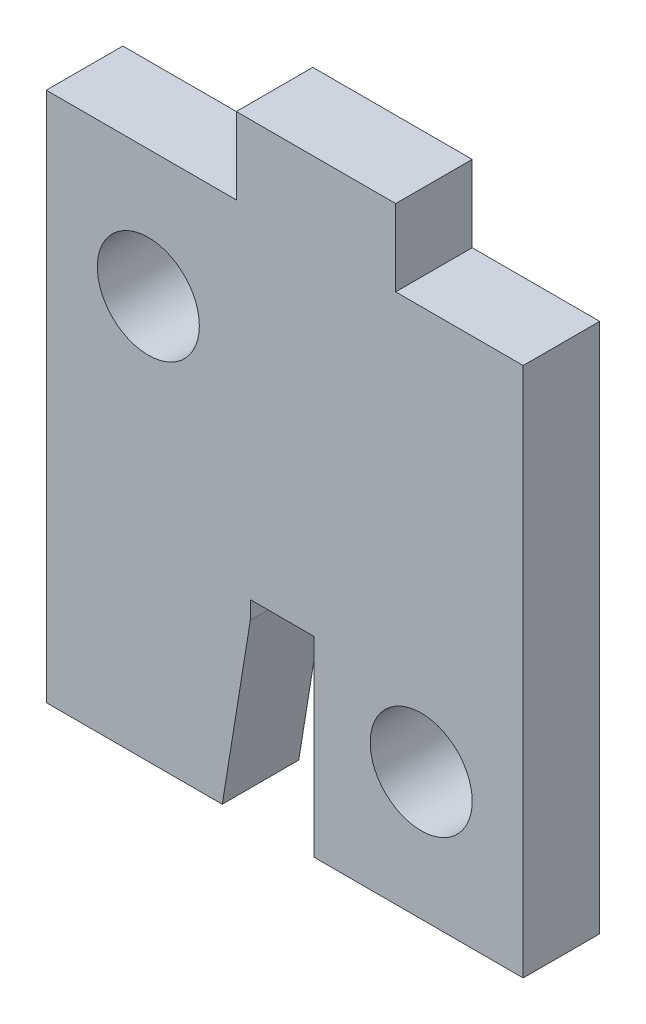
ISO-10303-21;
HEADER;
FILE_DESCRIPTION(('STEP AP214'),'2;1');
FILE_NAME('part.step','',(''),(''),'','','');
FILE_SCHEMA(('AUTOMOTIVE_DESIGN { 1 0 10303 214 1 1 1 1 }'));
ENDSEC;
DATA;
#1=APPLICATION_CONTEXT('core data for automotive mechanical design processes');
#2=APPLICATION_PROTOCOL_DEFINITION('international standard','automotive_design',2000,#1);
#3=PRODUCT_CONTEXT('',#1,'mechanical');
#4=PRODUCT('Part','Part','',(#3));
#5=PRODUCT_RELATED_PRODUCT_CATEGORY('part','',(#4));
#6=PRODUCT_DEFINITION_FORMATION('','',#4);
#7=PRODUCT_DEFINITION_CONTEXT('part definition',#1,'design');
#8=PRODUCT_DEFINITION('design','',#6,#7);
#9=PRODUCT_DEFINITION_SHAPE('','',#8);
#10=(LENGTH_UNIT() NAMED_UNIT(*) SI_UNIT(.MILLI.,.METRE.));
#11=(NAMED_UNIT(*) PLANE_ANGLE_UNIT() SI_UNIT($,.RADIAN.));
#12=(NAMED_UNIT(*) SI_UNIT($,.STERADIAN.) SOLID_ANGLE_UNIT());
#13=UNCERTAINTY_MEASURE_WITH_UNIT(LENGTH_MEASURE(1.E-05),#10,'distance_accuracy_value','');
#14=(GEOMETRIC_REPRESENTATION_CONTEXT(3) GLOBAL_UNCERTAINTY_ASSIGNED_CONTEXT((#13)) GLOBAL_UNIT_ASSIGNED_CONTEXT((#10,
#11,#12)) REPRESENTATION_CONTEXT('',''));
#15=CARTESIAN_POINT('',(0.,0.,0.));
#16=DIRECTION('',(0.,0.,1.));
#17=DIRECTION('',(1.,0.,0.));
#18=AXIS2_PLACEMENT_3D('',#15,#16,#17);
#19=CARTESIAN_POINT('',(0.,23.8,3.00000000000006));
#20=DIRECTION('',(-1.,0.,0.));
#21=DIRECTION('',(0.,-1.,0.));
#22=AXIS2_PLACEMENT_3D('',#19,#20,#21);
#23=PLANE('',#22);
#24=DIRECTION('',(0.,0.,1.));
#25=VECTOR('',#24,1.);
#26=CARTESIAN_POINT('',(0.,20.8,3.00000000000006));
#27=LINE('',#26,#25);
#28=CARTESIAN_POINT('',(0.,20.8,0.));
#29=VERTEX_POINT('',#28);
#30=CARTESIAN_POINT('',(0.,20.8,3.00000000000006));
#31=VERTEX_POINT('',#30);
#32=EDGE_CURVE('E86',#29,#31,#27,.T.);
#33=ORIENTED_EDGE('',*,*,#32,.F.);
#34=DIRECTION('',(0.,1.,0.));
#35=VECTOR('',#34,1.);
#36=CARTESIAN_POINT('',(0.,23.8,0.));
#37=LINE('',#36,#35);
#38=CARTESIAN_POINT('',(0.,23.8,0.));
#39=VERTEX_POINT('',#38);
#40=EDGE_CURVE('E217',#29,#39,#37,.T.);
#41=ORIENTED_EDGE('',*,*,#40,.T.);
#42=DIRECTION('',(0.,0.,-1.));
#43=VECTOR('',#42,1.);
#44=CARTESIAN_POINT('',(0.,23.8,3.00000000000006));
#45=LINE('',#44,#43);
#46=CARTESIAN_POINT('',(0.,23.8,3.00000000000006));
#47=VERTEX_POINT('',#46);
#48=EDGE_CURVE('E240',#47,#39,#45,.T.);
#49=ORIENTED_EDGE('',*,*,#48,.F.);
#50=DIRECTION('',(0.,1.,0.));
#51=VECTOR('',#50,1.);
#52=CARTESIAN_POINT('',(0.,23.8,3.00000000000006));
#53=LINE('',#52,#51);
#54=EDGE_CURVE('E226',#31,#47,#53,.T.);
#55=ORIENTED_EDGE('',*,*,#54,.F.);
#56=EDGE_LOOP('',(#33,#41,#49,#55));
#57=FACE_BOUND('',#56,.T.);
#58=ADVANCED_FACE('F54',(#57),#23,.F.);
#59=CARTESIAN_POINT('',(-13.7,0.,3.00000000000006));
#60=DIRECTION('',(1.,0.,0.));
#61=DIRECTION('',(0.,1.,0.));
#62=AXIS2_PLACEMENT_3D('',#59,#60,#61);
#63=PLANE('',#62);
#64=DIRECTION('',(0.,-1.,0.));
#65=VECTOR('',#64,1.);
#66=CARTESIAN_POINT('',(-13.7,0.,3.00000000000006));
#67=LINE('',#66,#65);
#68=CARTESIAN_POINT('',(-13.7,20.8,3.00000000000006));
#69=VERTEX_POINT('',#68);
#70=CARTESIAN_POINT('',(-13.7,0.,3.00000000000006));
#71=VERTEX_POINT('',#70);
#72=EDGE_CURVE('E268',#69,#71,#67,.T.);
#73=ORIENTED_EDGE('',*,*,#72,.F.);
#74=DIRECTION('',(0.,0.,1.));
#75=VECTOR('',#74,1.);
#76=CARTESIAN_POINT('',(-13.7,20.8,0.));
#77=LINE('',#76,#75);
#78=CARTESIAN_POINT('',(-13.7,20.8,0.));
#79=VERTEX_POINT('',#78);
#80=EDGE_CURVE('E259',#79,#69,#77,.T.);
#81=ORIENTED_EDGE('',*,*,#80,.F.);
#82=DIRECTION('',(0.,-1.,0.));
#83=VECTOR('',#82,1.);
#84=CARTESIAN_POINT('',(-13.7,0.,0.));
#85=LINE('',#84,#83);
#86=CARTESIAN_POINT('',(-13.7,0.,0.));
#87=VERTEX_POINT('',#86);
#88=EDGE_CURVE('E208',#79,#87,#85,.T.);
#89=ORIENTED_EDGE('',*,*,#88,.T.);
#90=DIRECTION('',(0.,0.,-1.));
#91=VECTOR('',#90,1.);
#92=CARTESIAN_POINT('',(-13.7,0.,3.00000000000006));
#93=LINE('',#92,#91);
#94=EDGE_CURVE('E13',#71,#87,#93,.T.);
#95=ORIENTED_EDGE('',*,*,#94,.F.);
#96=EDGE_LOOP('',(#73,#81,#89,#95));
#97=FACE_BOUND('',#96,.T.);
#98=ADVANCED_FACE('F56',(#97),#63,.F.);
#99=CARTESIAN_POINT('',(-13.7,0.,3.00000000000006));
#100=DIRECTION('',(0.,1.,0.));
#101=DIRECTION('',(-1.,0.,0.));
#102=AXIS2_PLACEMENT_3D('',#99,#100,#101);
#103=PLANE('',#102);
#104=DIRECTION('',(1.,0.,0.));
#105=VECTOR('',#104,1.);
#106=CARTESIAN_POINT('',(-13.7,0.,0.));
#107=LINE('',#106,#105);
#108=CARTESIAN_POINT('',(-6.79999999999996,0.,0.));
#109=VERTEX_POINT('',#108);
#110=EDGE_CURVE('E201',#87,#109,#107,.T.);
#111=ORIENTED_EDGE('',*,*,#110,.T.);
#112=DIRECTION('',(0.,0.,1.));
#113=VECTOR('',#112,1.);
#114=CARTESIAN_POINT('',(-6.79999999999996,0.,-0.00105000000000244));
#115=LINE('',#114,#113);
#116=CARTESIAN_POINT('',(-6.79999999999996,0.,3.00000000000006));
#117=VERTEX_POINT('',#116);
#118=EDGE_CURVE('E75',#109,#117,#115,.T.);
#119=ORIENTED_EDGE('',*,*,#118,.T.);
#120=DIRECTION('',(1.,0.,0.));
#121=VECTOR('',#120,1.);
#122=CARTESIAN_POINT('',(-13.7,0.,3.00000000000006));
#123=LINE('',#122,#121);
#124=EDGE_CURVE('E270',#71,#117,#123,.T.);
#125=ORIENTED_EDGE('',*,*,#124,.F.);
#126=ORIENTED_EDGE('',*,*,#94,.T.);
#127=EDGE_LOOP('',(#111,#119,#125,#126));
#128=FACE_BOUND('',#127,.T.);
#129=ADVANCED_FACE('F358',(#128),#103,.F.);
#130=CARTESIAN_POINT('',(-5.69999999999995,0.,3.00000000000006));
#131=DIRECTION('',(-1.,0.,0.));
#132=DIRECTION('',(0.,-1.,0.));
#133=AXIS2_PLACEMENT_3D('',#130,#131,#132);
#134=PLANE('',#133);
#135=DIRECTION('',(0.,1.,0.));
#136=VECTOR('',#135,1.);
#137=CARTESIAN_POINT('',(-5.69999999999995,0.,3.00000000000006));
#138=LINE('',#137,#136);
#139=CARTESIAN_POINT('',(-5.69999999999995,6.79999999999997,3.00000000000006));
#140=VERTEX_POINT('',#139);
#141=CARTESIAN_POINT('',(-5.69999999999995,7.49999999999999,3.00000000000006));
#142=VERTEX_POINT('',#141);
#143=EDGE_CURVE('E192',#140,#142,#138,.T.);
#144=ORIENTED_EDGE('',*,*,#143,.F.);
#145=DIRECTION('',(0.,0.,1.));
#146=VECTOR('',#145,1.);
#147=CARTESIAN_POINT('',(-5.69999999999997,6.79999999999997,-0.00105000000000244));
#148=LINE('',#147,#146);
#149=CARTESIAN_POINT('',(-5.69999999999997,6.79999999999997,0.));
#150=VERTEX_POINT('',#149);
#151=EDGE_CURVE('E178',#150,#140,#148,.T.);
#152=ORIENTED_EDGE('',*,*,#151,.F.);
#153=DIRECTION('',(0.,1.,0.));
#154=VECTOR('',#153,1.);
#155=CARTESIAN_POINT('',(-5.69999999999997,0.,0.));
#156=LINE('',#155,#154);
#157=CARTESIAN_POINT('',(-5.69999999999997,7.49999999999999,0.));
#158=VERTEX_POINT('',#157);
#159=EDGE_CURVE('E190',#150,#158,#156,.T.);
#160=ORIENTED_EDGE('',*,*,#159,.T.);
#161=DIRECTION('',(0.,0.,-1.));
#162=VECTOR('',#161,1.);
#163=CARTESIAN_POINT('',(-5.69999999999995,7.49999999999999,3.00000000000006));
#164=LINE('',#163,#162);
#165=EDGE_CURVE('E64',#142,#158,#164,.T.);
#166=ORIENTED_EDGE('',*,*,#165,.F.);
#167=EDGE_LOOP('',(#144,#152,#160,#166));
#168=FACE_BOUND('',#167,.T.);
#169=ADVANCED_FACE('F188',(#168),#134,.F.);
#170=CARTESIAN_POINT('',(-5.69999999999995,7.49999999999999,3.00000000000006));
#171=DIRECTION('',(0.,1.,0.));
#172=DIRECTION('',(0.,0.,1.));
#173=AXIS2_PLACEMENT_3D('',#170,#171,#172);
#174=PLANE('',#173);
#175=DIRECTION('',(1.,0.,0.));
#176=VECTOR('',#175,1.);
#177=CARTESIAN_POINT('',(-5.69999999999997,7.49999999999999,0.));
#178=LINE('',#177,#176);
#179=CARTESIAN_POINT('',(-3.19999999999995,7.50000000000001,0.));
#180=VERTEX_POINT('',#179);
#181=EDGE_CURVE('E199',#158,#180,#178,.T.);
#182=ORIENTED_EDGE('',*,*,#181,.T.);
#183=DIRECTION('',(0.,0.,-1.));
#184=VECTOR('',#183,1.);
#185=CARTESIAN_POINT('',(-3.19999999999995,7.50000000000001,3.00000000000006));
#186=LINE('',#185,#184);
#187=CARTESIAN_POINT('',(-3.19999999999995,7.50000000000001,3.00000000000006));
#188=VERTEX_POINT('',#187);
#189=EDGE_CURVE('E417',#188,#180,#186,.T.);
#190=ORIENTED_EDGE('',*,*,#189,.F.);
#191=DIRECTION('',(1.,0.,0.));
#192=VECTOR('',#191,1.);
#193=CARTESIAN_POINT('',(-5.69999999999995,7.49999999999999,3.00000000000006));
#194=LINE('',#193,#192);
#195=EDGE_CURVE('E275',#142,#188,#194,.T.);
#196=ORIENTED_EDGE('',*,*,#195,.F.);
#197=ORIENTED_EDGE('',*,*,#165,.T.);
#198=EDGE_LOOP('',(#182,#190,#196,#197));
#199=FACE_BOUND('',#198,.T.);
#200=ADVANCED_FACE('F368',(#199),#174,.F.);
#201=CARTESIAN_POINT('',(-3.19999999999995,7.50000000000001,3.00000000000006));
#202=DIRECTION('',(1.,0.,0.));
#203=DIRECTION('',(0.,1.,0.));
#204=AXIS2_PLACEMENT_3D('',#201,#202,#203);
#205=PLANE('',#204);
#206=DIRECTION('',(0.,-1.,0.));
#207=VECTOR('',#206,1.);
#208=CARTESIAN_POINT('',(-3.19999999999995,7.50000000000001,0.));
#209=LINE('',#208,#207);
#210=CARTESIAN_POINT('',(-3.19999999999997,0.,0.));
#211=VERTEX_POINT('',#210);
#212=EDGE_CURVE('E205',#180,#211,#209,.T.);
#213=ORIENTED_EDGE('',*,*,#212,.T.);
#214=DIRECTION('',(0.,0.,-1.));
#215=VECTOR('',#214,1.);
#216=CARTESIAN_POINT('',(-3.19999999999995,0.,3.00000000000006));
#217=LINE('',#216,#215);
#218=CARTESIAN_POINT('',(-3.19999999999995,0.,3.00000000000006));
#219=VERTEX_POINT('',#218);
#220=EDGE_CURVE('E419',#219,#211,#217,.T.);
#221=ORIENTED_EDGE('',*,*,#220,.F.);
#222=DIRECTION('',(0.,-1.,0.));
#223=VECTOR('',#222,1.);
#224=CARTESIAN_POINT('',(-3.19999999999995,7.50000000000001,3.00000000000006));
#225=LINE('',#224,#223);
#226=EDGE_CURVE('E277',#188,#219,#225,.T.);
#227=ORIENTED_EDGE('',*,*,#226,.F.);
#228=ORIENTED_EDGE('',*,*,#189,.T.);
#229=EDGE_LOOP('',(#213,#221,#227,#228));
#230=FACE_BOUND('',#229,.T.);
#231=ADVANCED_FACE('F365',(#230),#205,.F.);
#232=CARTESIAN_POINT('',(-3.19999999999995,0.,3.00000000000006));
#233=DIRECTION('',(0.,1.,0.));
#234=DIRECTION('',(-1.,0.,0.));
#235=AXIS2_PLACEMENT_3D('',#232,#233,#234);
#236=PLANE('',#235);
#237=DIRECTION('',(1.,0.,0.));
#238=VECTOR('',#237,1.);
#239=CARTESIAN_POINT('',(-3.19999999999997,0.,0.));
#240=LINE('',#239,#238);
#241=CARTESIAN_POINT('',(4.99999999999999,0.,0.));
#242=VERTEX_POINT('',#241);
#243=EDGE_CURVE('E214',#211,#242,#240,.T.);
#244=ORIENTED_EDGE('',*,*,#243,.T.);
#245=DIRECTION('',(0.,0.,-1.));
#246=VECTOR('',#245,1.);
#247=CARTESIAN_POINT('',(4.99999999999999,0.,3.00000000000006));
#248=LINE('',#247,#246);
#249=CARTESIAN_POINT('',(4.99999999999999,0.,3.00000000000006));
#250=VERTEX_POINT('',#249);
#251=EDGE_CURVE('E297',#250,#242,#248,.T.);
#252=ORIENTED_EDGE('',*,*,#251,.F.);
#253=DIRECTION('',(1.,0.,0.));
#254=VECTOR('',#253,1.);
#255=CARTESIAN_POINT('',(-3.19999999999995,0.,3.00000000000006));
#256=LINE('',#255,#254);
#257=EDGE_CURVE('E231',#219,#250,#256,.T.);
#258=ORIENTED_EDGE('',*,*,#257,.F.);
#259=ORIENTED_EDGE('',*,*,#220,.T.);
#260=EDGE_LOOP('',(#244,#252,#258,#259));
#261=FACE_BOUND('',#260,.T.);
#262=ADVANCED_FACE('F298',(#261),#236,.F.);
#263=CARTESIAN_POINT('',(-13.7,23.8,3.00000000000006));
#264=DIRECTION('',(0.,-1.,0.));
#265=DIRECTION('',(0.,0.,-1.));
#266=AXIS2_PLACEMENT_3D('',#263,#264,#265);
#267=PLANE('',#266);
#268=DIRECTION('',(-1.,0.,0.));
#269=VECTOR('',#268,1.);
#270=CARTESIAN_POINT('',(-13.7,23.8,0.));
#271=LINE('',#270,#269);
#272=CARTESIAN_POINT('',(-6.24999999999998,23.8,0.));
#273=VERTEX_POINT('',#272);
#274=EDGE_CURVE('E220',#39,#273,#271,.T.);
#275=ORIENTED_EDGE('',*,*,#274,.T.);
#276=DIRECTION('',(0.,0.,1.));
#277=VECTOR('',#276,1.);
#278=CARTESIAN_POINT('',(-6.24999999999998,23.8,0.));
#279=LINE('',#278,#277);
#280=CARTESIAN_POINT('',(-6.24999999999998,23.8,3.00000000000006));
#281=VERTEX_POINT('',#280);
#282=EDGE_CURVE('E242',#273,#281,#279,.T.);
#283=ORIENTED_EDGE('',*,*,#282,.T.);
#284=DIRECTION('',(-1.,0.,0.));
#285=VECTOR('',#284,1.);
#286=CARTESIAN_POINT('',(-13.7,23.8,3.00000000000006));
#287=LINE('',#286,#285);
#288=EDGE_CURVE('E230',#47,#281,#287,.T.);
#289=ORIENTED_EDGE('',*,*,#288,.F.);
#290=ORIENTED_EDGE('',*,*,#48,.T.);
#291=EDGE_LOOP('',(#275,#283,#289,#290));
#292=FACE_BOUND('',#291,.T.);
#293=ADVANCED_FACE('F361',(#292),#267,.F.);
#294=CARTESIAN_POINT('',(0.,0.,3.00000000000006));
#295=DIRECTION('',(0.,0.,-1.));
#296=DIRECTION('',(-1.,0.,0.));
#297=AXIS2_PLACEMENT_3D('',#294,#295,#296);
#298=PLANE('',#297);
#299=CARTESIAN_POINT('',(-9.7,15.8,3.00000000000006));
#300=DIRECTION('',(0.,0.,1.));
#301=DIRECTION('',(1.,0.,0.));
#302=AXIS2_PLACEMENT_3D('',#299,#300,#301);
#303=CIRCLE('',#302,1.99999999999999);
#304=CARTESIAN_POINT('',(-7.70000000000001,15.8,3.00000000000006));
#305=VERTEX_POINT('',#304);
#306=EDGE_CURVE('E396',#305,#305,#303,.T.);
#307=ORIENTED_EDGE('',*,*,#306,.F.);
#308=EDGE_LOOP('',(#307));
#309=FACE_BOUND('',#308,.T.);
#310=CARTESIAN_POINT('',(1.,5.,3.00000000000006));
#311=DIRECTION('',(0.,0.,1.));
#312=DIRECTION('',(1.,0.,0.));
#313=AXIS2_PLACEMENT_3D('',#310,#311,#312);
#314=CIRCLE('',#313,1.99999999999999);
#315=CARTESIAN_POINT('',(2.99999999999999,5.,3.00000000000006));
#316=VERTEX_POINT('',#315);
#317=EDGE_CURVE('E399',#316,#316,#314,.T.);
#318=ORIENTED_EDGE('',*,*,#317,.F.);
#319=EDGE_LOOP('',(#318));
#320=FACE_BOUND('',#319,.T.);
#321=ORIENTED_EDGE('',*,*,#124,.T.);
#322=DIRECTION('',(-0.159688843913374,-0.98716739873722,0.));
#323=VECTOR('',#322,1.);
#324=CARTESIAN_POINT('',(-6.79999999999996,0.,3.00000000000006));
#325=LINE('',#324,#323);
#326=EDGE_CURVE('E194',#140,#117,#325,.T.);
#327=ORIENTED_EDGE('',*,*,#326,.F.);
#328=ORIENTED_EDGE('',*,*,#143,.T.);
#329=ORIENTED_EDGE('',*,*,#195,.T.);
#330=ORIENTED_EDGE('',*,*,#226,.T.);
#331=ORIENTED_EDGE('',*,*,#257,.T.);
#332=DIRECTION('',(0.,-1.,0.));
#333=VECTOR('',#332,1.);
#334=CARTESIAN_POINT('',(4.99999999999999,0.,3.00000000000006));
#335=LINE('',#334,#333);
#336=CARTESIAN_POINT('',(5.,20.8,3.00000000000006));
#337=VERTEX_POINT('',#336);
#338=EDGE_CURVE('E293',#337,#250,#335,.T.);
#339=ORIENTED_EDGE('',*,*,#338,.F.);
#340=DIRECTION('',(-1.,0.,0.));
#341=VECTOR('',#340,1.);
#342=CARTESIAN_POINT('',(5.,20.8,3.00000000000006));
#343=LINE('',#342,#341);
#344=EDGE_CURVE('E314',#337,#31,#343,.T.);
#345=ORIENTED_EDGE('',*,*,#344,.T.);
#346=ORIENTED_EDGE('',*,*,#54,.T.);
#347=ORIENTED_EDGE('',*,*,#288,.T.);
#348=DIRECTION('',(0.,1.,0.));
#349=VECTOR('',#348,1.);
#350=CARTESIAN_POINT('',(-6.24999999999998,23.8,3.00000000000006));
#351=LINE('',#350,#349);
#352=CARTESIAN_POINT('',(-6.24999999999999,20.8,3.00000000000006));
#353=VERTEX_POINT('',#352);
#354=EDGE_CURVE('E262',#353,#281,#351,.T.);
#355=ORIENTED_EDGE('',*,*,#354,.F.);
#356=DIRECTION('',(1.,0.,0.));
#357=VECTOR('',#356,1.);
#358=CARTESIAN_POINT('',(-13.7,20.8,3.00000000000006));
#359=LINE('',#358,#357);
#360=EDGE_CURVE('E323',#69,#353,#359,.T.);
#361=ORIENTED_EDGE('',*,*,#360,.F.);
#362=ORIENTED_EDGE('',*,*,#72,.T.);
#363=EDGE_LOOP('',(#321,#327,#328,#329,#330,#331,#339,#345,#346,#347,#355,#361,#362));
#364=FACE_BOUND('',#363,.T.);
#365=ADVANCED_FACE('F290',(#309,#320,#364),#298,.F.);
#366=CARTESIAN_POINT('',(0.,0.,0.));
#367=DIRECTION('',(0.,0.,-1.));
#368=DIRECTION('',(-1.,0.,0.));
#369=AXIS2_PLACEMENT_3D('',#366,#367,#368);
#370=PLANE('',#369);
#371=CARTESIAN_POINT('',(-9.7,15.8,0.));
#372=DIRECTION('',(0.,0.,-1.));
#373=DIRECTION('',(-1.,0.,0.));
#374=AXIS2_PLACEMENT_3D('',#371,#372,#373);
#375=CIRCLE('',#374,1.99999999999999);
#376=CARTESIAN_POINT('',(-11.7,15.8,0.));
#377=VERTEX_POINT('',#376);
#378=EDGE_CURVE('E402',#377,#377,#375,.T.);
#379=ORIENTED_EDGE('',*,*,#378,.F.);
#380=EDGE_LOOP('',(#379));
#381=FACE_BOUND('',#380,.T.);
#382=CARTESIAN_POINT('',(1.,5.,0.));
#383=DIRECTION('',(0.,0.,-1.));
#384=DIRECTION('',(-1.,0.,0.));
#385=AXIS2_PLACEMENT_3D('',#382,#383,#384);
#386=CIRCLE('',#385,1.99999999999999);
#387=CARTESIAN_POINT('',(-0.999999999999993,5.,0.));
#388=VERTEX_POINT('',#387);
#389=EDGE_CURVE('E401',#388,#388,#386,.T.);
#390=ORIENTED_EDGE('',*,*,#389,.F.);
#391=EDGE_LOOP('',(#390));
#392=FACE_BOUND('',#391,.T.);
#393=DIRECTION('',(-0.159688843913374,-0.98716739873722,0.));
#394=VECTOR('',#393,1.);
#395=CARTESIAN_POINT('',(-6.79999999999996,0.,0.));
#396=LINE('',#395,#394);
#397=EDGE_CURVE('E175',#150,#109,#396,.T.);
#398=ORIENTED_EDGE('',*,*,#397,.T.);
#399=ORIENTED_EDGE('',*,*,#110,.F.);
#400=ORIENTED_EDGE('',*,*,#88,.F.);
#401=DIRECTION('',(1.,0.,0.));
#402=VECTOR('',#401,1.);
#403=CARTESIAN_POINT('',(-13.7,20.8,0.));
#404=LINE('',#403,#402);
#405=CARTESIAN_POINT('',(-6.24999999999999,20.8,0.));
#406=VERTEX_POINT('',#405);
#407=EDGE_CURVE('E317',#79,#406,#404,.T.);
#408=ORIENTED_EDGE('',*,*,#407,.T.);
#409=DIRECTION('',(0.,1.,0.));
#410=VECTOR('',#409,1.);
#411=CARTESIAN_POINT('',(-6.24999999999998,23.8,0.));
#412=LINE('',#411,#410);
#413=EDGE_CURVE('E267',#406,#273,#412,.T.);
#414=ORIENTED_EDGE('',*,*,#413,.T.);
#415=ORIENTED_EDGE('',*,*,#274,.F.);
#416=ORIENTED_EDGE('',*,*,#40,.F.);
#417=DIRECTION('',(-1.,0.,0.));
#418=VECTOR('',#417,1.);
#419=CARTESIAN_POINT('',(5.,20.8,0.));
#420=LINE('',#419,#418);
#421=CARTESIAN_POINT('',(5.,20.8,0.));
#422=VERTEX_POINT('',#421);
#423=EDGE_CURVE('E326',#422,#29,#420,.T.);
#424=ORIENTED_EDGE('',*,*,#423,.F.);
#425=DIRECTION('',(0.,1.,0.));
#426=VECTOR('',#425,1.);
#427=CARTESIAN_POINT('',(4.99999999999999,0.,0.));
#428=LINE('',#427,#426);
#429=EDGE_CURVE('E302',#242,#422,#428,.T.);
#430=ORIENTED_EDGE('',*,*,#429,.F.);
#431=ORIENTED_EDGE('',*,*,#243,.F.);
#432=ORIENTED_EDGE('',*,*,#212,.F.);
#433=ORIENTED_EDGE('',*,*,#181,.F.);
#434=ORIENTED_EDGE('',*,*,#159,.F.);
#435=EDGE_LOOP('',(#398,#399,#400,#408,#414,#415,#416,#424,#430,#431,#432,#433,#434));
#436=FACE_BOUND('',#435,.T.);
#437=ADVANCED_FACE('F197',(#381,#392,#436),#370,.T.);
#438=CARTESIAN_POINT('',(-6.24999999999998,23.8,0.));
#439=DIRECTION('',(1.,0.,0.));
#440=DIRECTION('',(0.,0.,-1.));
#441=AXIS2_PLACEMENT_3D('',#438,#439,#440);
#442=PLANE('',#441);
#443=ORIENTED_EDGE('',*,*,#354,.T.);
#444=ORIENTED_EDGE('',*,*,#282,.F.);
#445=ORIENTED_EDGE('',*,*,#413,.F.);
#446=DIRECTION('',(0.,0.,1.));
#447=VECTOR('',#446,1.);
#448=CARTESIAN_POINT('',(-6.24999999999999,20.8,0.));
#449=LINE('',#448,#447);
#450=EDGE_CURVE('E251',#406,#353,#449,.T.);
#451=ORIENTED_EDGE('',*,*,#450,.T.);
#452=EDGE_LOOP('',(#443,#444,#445,#451));
#453=FACE_BOUND('',#452,.T.);
#454=ADVANCED_FACE('F350',(#453),#442,.F.);
#455=CARTESIAN_POINT('',(-13.7,20.8,0.));
#456=DIRECTION('',(0.,-1.,0.));
#457=DIRECTION('',(0.,0.,-1.));
#458=AXIS2_PLACEMENT_3D('',#455,#456,#457);
#459=PLANE('',#458);
#460=ORIENTED_EDGE('',*,*,#360,.T.);
#461=ORIENTED_EDGE('',*,*,#450,.F.);
#462=ORIENTED_EDGE('',*,*,#407,.F.);
#463=ORIENTED_EDGE('',*,*,#80,.T.);
#464=EDGE_LOOP('',(#460,#461,#462,#463));
#465=FACE_BOUND('',#464,.T.);
#466=ADVANCED_FACE('F343',(#465),#459,.F.);
#467=CARTESIAN_POINT('',(5.,20.8,3.00000000000006));
#468=DIRECTION('',(0.,-1.,0.));
#469=DIRECTION('',(1.,0.,0.));
#470=AXIS2_PLACEMENT_3D('',#467,#468,#469);
#471=PLANE('',#470);
#472=ORIENTED_EDGE('',*,*,#32,.T.);
#473=ORIENTED_EDGE('',*,*,#344,.F.);
#474=DIRECTION('',(0.,0.,1.));
#475=VECTOR('',#474,1.);
#476=CARTESIAN_POINT('',(5.,20.8,3.00000000000006));
#477=LINE('',#476,#475);
#478=EDGE_CURVE('E306',#422,#337,#477,.T.);
#479=ORIENTED_EDGE('',*,*,#478,.F.);
#480=ORIENTED_EDGE('',*,*,#423,.T.);
#481=EDGE_LOOP('',(#472,#473,#479,#480));
#482=FACE_BOUND('',#481,.T.);
#483=ADVANCED_FACE('F341',(#482),#471,.F.);
#484=CARTESIAN_POINT('',(4.99999999999999,0.,0.));
#485=DIRECTION('',(-1.,0.,0.));
#486=DIRECTION('',(0.,-1.,0.));
#487=AXIS2_PLACEMENT_3D('',#484,#485,#486);
#488=PLANE('',#487);
#489=ORIENTED_EDGE('',*,*,#338,.T.);
#490=ORIENTED_EDGE('',*,*,#251,.T.);
#491=ORIENTED_EDGE('',*,*,#429,.T.);
#492=ORIENTED_EDGE('',*,*,#478,.T.);
#493=EDGE_LOOP('',(#489,#490,#491,#492));
#494=FACE_BOUND('',#493,.T.);
#495=ADVANCED_FACE('F304',(#494),#488,.F.);
#496=CARTESIAN_POINT('',(-6.79999999999996,0.,-0.00105000000000244));
#497=DIRECTION('',(-0.98716739873722,0.159688843913373,0.));
#498=DIRECTION('',(-0.159688843913374,-0.98716739873722,0.));
#499=AXIS2_PLACEMENT_3D('',#496,#497,#498);
#500=PLANE('',#499);
#501=ORIENTED_EDGE('',*,*,#151,.T.);
#502=ORIENTED_EDGE('',*,*,#326,.T.);
#503=ORIENTED_EDGE('',*,*,#118,.F.);
#504=ORIENTED_EDGE('',*,*,#397,.F.);
#505=EDGE_LOOP('',(#501,#502,#503,#504));
#506=FACE_BOUND('',#505,.T.);
#507=ADVANCED_FACE('F177',(#506),#500,.F.);
#508=CARTESIAN_POINT('',(1.,5.,3.00000000000006));
#509=DIRECTION('',(0.,0.,1.));
#510=DIRECTION('',(1.,0.,0.));
#511=AXIS2_PLACEMENT_3D('',#508,#509,#510);
#512=CYLINDRICAL_SURFACE('',#511,1.99999999999999);
#513=ORIENTED_EDGE('',*,*,#317,.T.);
#514=EDGE_LOOP('',(#513));
#515=FACE_BOUND('',#514,.T.);
#516=ORIENTED_EDGE('',*,*,#389,.T.);
#517=EDGE_LOOP('',(#516));
#518=FACE_BOUND('',#517,.T.);
#519=ADVANCED_FACE('F428',(#515,#518),#512,.F.);
#520=CARTESIAN_POINT('',(-9.7,15.8,3.00000000000006));
#521=DIRECTION('',(0.,0.,1.));
#522=DIRECTION('',(1.,0.,0.));
#523=AXIS2_PLACEMENT_3D('',#520,#521,#522);
#524=CYLINDRICAL_SURFACE('',#523,1.99999999999999);
#525=ORIENTED_EDGE('',*,*,#306,.T.);
#526=EDGE_LOOP('',(#525));
#527=FACE_BOUND('',#526,.T.);
#528=ORIENTED_EDGE('',*,*,#378,.T.);
#529=EDGE_LOOP('',(#528));
#530=FACE_BOUND('',#529,.T.);
#531=ADVANCED_FACE('F425',(#527,#530),#524,.F.);
#532=CLOSED_SHELL('',(#58,#98,#129,#169,#200,#231,#262,#293,#365,#437,#454,#466,#483,#495,#507,
#519,#531));
#533=MANIFOLD_SOLID_BREP('B2',#532);
#534=ADVANCED_BREP_SHAPE_REPRESENTATION('',(#18,#533),#14);
#535=SHAPE_DEFINITION_REPRESENTATION(#9,#534);
ENDSEC;
END-ISO-10303-21;
